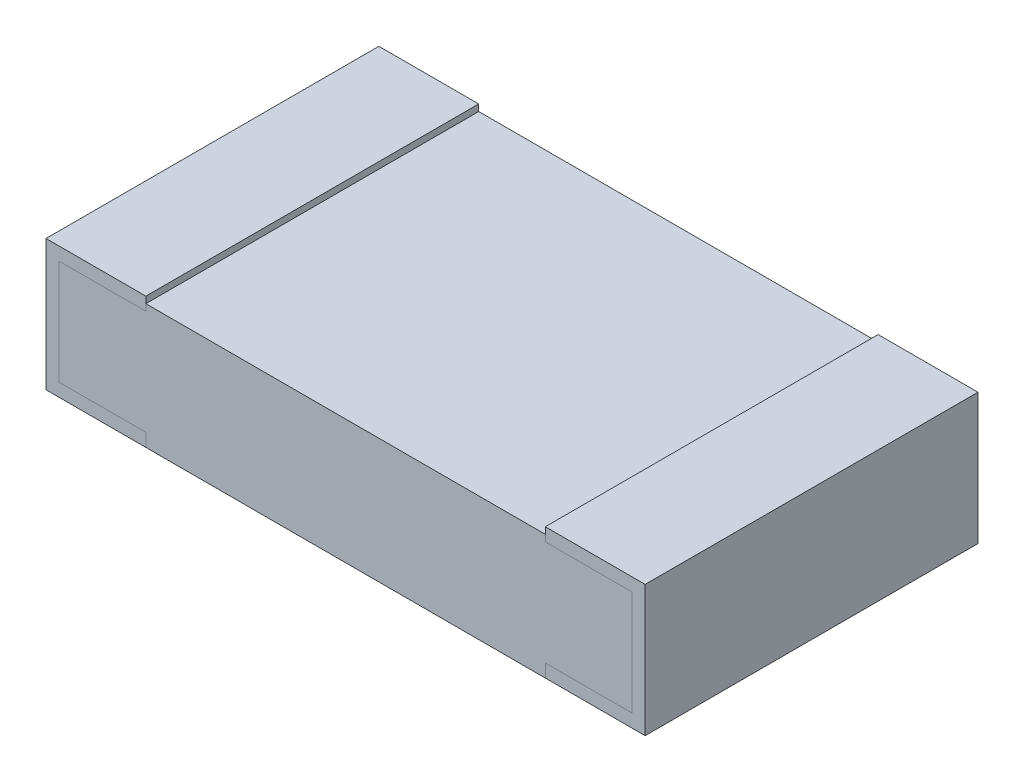
ISO-10303-21;
HEADER;
FILE_DESCRIPTION(('STEP AP214'),'2;1');
FILE_NAME('part.step','',(''),(''),'','','');
FILE_SCHEMA(('AUTOMOTIVE_DESIGN { 1 0 10303 214 1 1 1 1 }'));
ENDSEC;
DATA;
#1=APPLICATION_CONTEXT('core data for automotive mechanical design processes');
#2=APPLICATION_PROTOCOL_DEFINITION('international standard','automotive_design',2000,#1);
#3=PRODUCT_CONTEXT('',#1,'mechanical');
#4=PRODUCT('Part','Part','',(#3));
#5=PRODUCT_RELATED_PRODUCT_CATEGORY('part','',(#4));
#6=PRODUCT_DEFINITION_FORMATION('','',#4);
#7=PRODUCT_DEFINITION_CONTEXT('part definition',#1,'design');
#8=PRODUCT_DEFINITION('design','',#6,#7);
#9=PRODUCT_DEFINITION_SHAPE('','',#8);
#10=(LENGTH_UNIT() NAMED_UNIT(*) SI_UNIT(.MILLI.,.METRE.));
#11=(NAMED_UNIT(*) PLANE_ANGLE_UNIT() SI_UNIT($,.RADIAN.));
#12=(NAMED_UNIT(*) SI_UNIT($,.STERADIAN.) SOLID_ANGLE_UNIT());
#13=UNCERTAINTY_MEASURE_WITH_UNIT(LENGTH_MEASURE(1.E-05),#10,'distance_accuracy_value','');
#14=(GEOMETRIC_REPRESENTATION_CONTEXT(3) GLOBAL_UNCERTAINTY_ASSIGNED_CONTEXT((#13)) GLOBAL_UNIT_ASSIGNED_CONTEXT((#10,
#11,#12)) REPRESENTATION_CONTEXT('',''));
#15=CARTESIAN_POINT('',(0.,0.,0.));
#16=DIRECTION('',(0.,0.,1.));
#17=DIRECTION('',(1.,0.,0.));
#18=AXIS2_PLACEMENT_3D('',#15,#16,#17);
#19=CARTESIAN_POINT('',(-0.762,0.,1.27));
#20=DIRECTION('',(1.,0.,0.));
#21=DIRECTION('',(0.,1.,0.));
#22=AXIS2_PLACEMENT_3D('',#19,#20,#21);
#23=PLANE('',#22);
#24=DIRECTION('',(0.,1.,0.));
#25=VECTOR('',#24,1.);
#26=CARTESIAN_POINT('',(-0.762,0.,1.27));
#27=LINE('',#26,#25);
#28=CARTESIAN_POINT('',(-0.762,0.,1.27));
#29=VERTEX_POINT('',#28);
#30=CARTESIAN_POINT('',(-0.762,0.0499999999999999,1.27));
#31=VERTEX_POINT('',#30);
#32=EDGE_CURVE('P0_E105',#29,#31,#27,.T.);
#33=ORIENTED_EDGE('',*,*,#32,.F.);
#34=DIRECTION('',(0.,0.,1.));
#35=VECTOR('',#34,1.);
#36=CARTESIAN_POINT('',(-0.762,0.,1.27));
#37=LINE('',#36,#35);
#38=CARTESIAN_POINT('',(-0.762,0.,0.));
#39=VERTEX_POINT('',#38);
#40=EDGE_CURVE('P0_E135',#29,#39,#37,.F.);
#41=ORIENTED_EDGE('',*,*,#40,.T.);
#42=DIRECTION('',(0.,1.,0.));
#43=VECTOR('',#42,1.);
#44=CARTESIAN_POINT('',(-0.762,0.,0.));
#45=LINE('',#44,#43);
#46=CARTESIAN_POINT('',(-0.762,0.0499999999999999,0.));
#47=VERTEX_POINT('',#46);
#48=EDGE_CURVE('P0_E131',#39,#47,#45,.T.);
#49=ORIENTED_EDGE('',*,*,#48,.T.);
#50=DIRECTION('',(0.,0.,1.));
#51=VECTOR('',#50,1.);
#52=CARTESIAN_POINT('',(-0.762,0.0499999999999999,1.27));
#53=LINE('',#52,#51);
#54=EDGE_CURVE('P0_E19',#31,#47,#53,.F.);
#55=ORIENTED_EDGE('',*,*,#54,.F.);
#56=EDGE_LOOP('',(#33,#41,#49,#55));
#57=FACE_BOUND('',#56,.T.);
#58=ADVANCED_FACE('P0_F16',(#57),#23,.T.);
#59=CARTESIAN_POINT('',(0.,0.0499999999999999,1.27));
#60=DIRECTION('',(0.,1.,0.));
#61=DIRECTION('',(0.,0.,1.));
#62=AXIS2_PLACEMENT_3D('',#59,#60,#61);
#63=PLANE('',#62);
#64=DIRECTION('',(1.,0.,0.));
#65=VECTOR('',#64,1.);
#66=CARTESIAN_POINT('',(0.,0.0499999999999999,1.27));
#67=LINE('',#66,#65);
#68=CARTESIAN_POINT('',(-1.093,0.0499999999999999,1.27));
#69=VERTEX_POINT('',#68);
#70=EDGE_CURVE('P0_E107',#31,#69,#67,.F.);
#71=ORIENTED_EDGE('',*,*,#70,.F.);
#72=ORIENTED_EDGE('',*,*,#54,.T.);
#73=DIRECTION('',(1.,0.,0.));
#74=VECTOR('',#73,1.);
#75=CARTESIAN_POINT('',(0.,0.0499999999999999,0.));
#76=LINE('',#75,#74);
#77=CARTESIAN_POINT('',(-1.093,0.0499999999999999,0.));
#78=VERTEX_POINT('',#77);
#79=EDGE_CURVE('P0_E126',#47,#78,#76,.F.);
#80=ORIENTED_EDGE('',*,*,#79,.T.);
#81=DIRECTION('',(0.,0.,-1.));
#82=VECTOR('',#81,1.);
#83=CARTESIAN_POINT('',(-1.093,0.0499999999999999,1.27));
#84=LINE('',#83,#82);
#85=EDGE_CURVE('P0_E114',#69,#78,#84,.T.);
#86=ORIENTED_EDGE('',*,*,#85,.F.);
#87=EDGE_LOOP('',(#71,#72,#80,#86));
#88=FACE_BOUND('',#87,.T.);
#89=ADVANCED_FACE('P0_F125',(#88),#63,.T.);
#90=CARTESIAN_POINT('',(-1.093,0.,1.27));
#91=DIRECTION('',(1.,0.,0.));
#92=DIRECTION('',(0.,0.,-1.));
#93=AXIS2_PLACEMENT_3D('',#90,#91,#92);
#94=PLANE('',#93);
#95=DIRECTION('',(0.,1.,0.));
#96=VECTOR('',#95,1.);
#97=CARTESIAN_POINT('',(-1.093,0.,1.27));
#98=LINE('',#97,#96);
#99=CARTESIAN_POINT('',(-1.093,0.45,1.27));
#100=VERTEX_POINT('',#99);
#101=EDGE_CURVE('P0_E147',#69,#100,#98,.T.);
#102=ORIENTED_EDGE('',*,*,#101,.F.);
#103=ORIENTED_EDGE('',*,*,#85,.T.);
#104=DIRECTION('',(0.,1.,0.));
#105=VECTOR('',#104,1.);
#106=CARTESIAN_POINT('',(-1.093,0.,0.));
#107=LINE('',#106,#105);
#108=CARTESIAN_POINT('',(-1.093,0.45,0.));
#109=VERTEX_POINT('',#108);
#110=EDGE_CURVE('P0_E132',#78,#109,#107,.T.);
#111=ORIENTED_EDGE('',*,*,#110,.T.);
#112=DIRECTION('',(0.,0.,1.));
#113=VECTOR('',#112,1.);
#114=CARTESIAN_POINT('',(-1.093,0.45,1.27));
#115=LINE('',#114,#113);
#116=EDGE_CURVE('P0_E112',#109,#100,#115,.T.);
#117=ORIENTED_EDGE('',*,*,#116,.T.);
#118=EDGE_LOOP('',(#102,#103,#111,#117));
#119=FACE_BOUND('',#118,.T.);
#120=ADVANCED_FACE('P0_F148',(#119),#94,.T.);
#121=CARTESIAN_POINT('',(0.,0.45,1.27));
#122=DIRECTION('',(0.,1.,0.));
#123=DIRECTION('',(0.,0.,1.));
#124=AXIS2_PLACEMENT_3D('',#121,#122,#123);
#125=PLANE('',#124);
#126=DIRECTION('',(0.,0.,1.));
#127=VECTOR('',#126,1.);
#128=CARTESIAN_POINT('',(-0.762,0.45,1.27));
#129=LINE('',#128,#127);
#130=CARTESIAN_POINT('',(-0.762,0.45,1.27));
#131=VERTEX_POINT('',#130);
#132=CARTESIAN_POINT('',(-0.762,0.45,0.));
#133=VERTEX_POINT('',#132);
#134=EDGE_CURVE('P0_E78',#131,#133,#129,.F.);
#135=ORIENTED_EDGE('',*,*,#134,.F.);
#136=DIRECTION('',(1.,0.,0.));
#137=VECTOR('',#136,1.);
#138=CARTESIAN_POINT('',(0.,0.45,1.27));
#139=LINE('',#138,#137);
#140=EDGE_CURVE('P0_E90',#100,#131,#139,.T.);
#141=ORIENTED_EDGE('',*,*,#140,.F.);
#142=ORIENTED_EDGE('',*,*,#116,.F.);
#143=DIRECTION('',(1.,0.,0.));
#144=VECTOR('',#143,1.);
#145=CARTESIAN_POINT('',(0.,0.45,0.));
#146=LINE('',#145,#144);
#147=EDGE_CURVE('P0_E248',#109,#133,#146,.T.);
#148=ORIENTED_EDGE('',*,*,#147,.T.);
#149=EDGE_LOOP('',(#135,#141,#142,#148));
#150=FACE_BOUND('',#149,.T.);
#151=ADVANCED_FACE('P0_F149',(#150),#125,.F.);
#152=CARTESIAN_POINT('',(-0.762,0.,1.27));
#153=DIRECTION('',(1.,0.,0.));
#154=DIRECTION('',(0.,1.,0.));
#155=AXIS2_PLACEMENT_3D('',#152,#153,#154);
#156=PLANE('',#155);
#157=DIRECTION('',(0.,1.,0.));
#158=VECTOR('',#157,1.);
#159=CARTESIAN_POINT('',(-0.762,0.,1.27));
#160=LINE('',#159,#158);
#161=CARTESIAN_POINT('',(-0.762,0.5,1.27));
#162=VERTEX_POINT('',#161);
#163=EDGE_CURVE('P0_E83',#131,#162,#160,.T.);
#164=ORIENTED_EDGE('',*,*,#163,.F.);
#165=ORIENTED_EDGE('',*,*,#134,.T.);
#166=DIRECTION('',(0.,1.,0.));
#167=VECTOR('',#166,1.);
#168=CARTESIAN_POINT('',(-0.762,0.,0.));
#169=LINE('',#168,#167);
#170=CARTESIAN_POINT('',(-0.762,0.5,0.));
#171=VERTEX_POINT('',#170);
#172=EDGE_CURVE('P0_E97',#133,#171,#169,.T.);
#173=ORIENTED_EDGE('',*,*,#172,.T.);
#174=DIRECTION('',(0.,0.,1.));
#175=VECTOR('',#174,1.);
#176=CARTESIAN_POINT('',(-0.762,0.5,1.27));
#177=LINE('',#176,#175);
#178=EDGE_CURVE('P0_E92',#162,#171,#177,.F.);
#179=ORIENTED_EDGE('',*,*,#178,.F.);
#180=EDGE_LOOP('',(#164,#165,#173,#179));
#181=FACE_BOUND('',#180,.T.);
#182=ADVANCED_FACE('P0_F95',(#181),#156,.T.);
#183=CARTESIAN_POINT('',(0.,0.5,1.27));
#184=DIRECTION('',(0.,1.,0.));
#185=DIRECTION('',(0.,0.,1.));
#186=AXIS2_PLACEMENT_3D('',#183,#184,#185);
#187=PLANE('',#186);
#188=DIRECTION('',(1.,0.,0.));
#189=VECTOR('',#188,1.);
#190=CARTESIAN_POINT('',(0.,0.5,1.27));
#191=LINE('',#190,#189);
#192=CARTESIAN_POINT('',(-1.143,0.5,1.27));
#193=VERTEX_POINT('',#192);
#194=EDGE_CURVE('P0_E88',#162,#193,#191,.F.);
#195=ORIENTED_EDGE('',*,*,#194,.F.);
#196=ORIENTED_EDGE('',*,*,#178,.T.);
#197=DIRECTION('',(1.,0.,0.));
#198=VECTOR('',#197,1.);
#199=CARTESIAN_POINT('',(0.,0.5,0.));
#200=LINE('',#199,#198);
#201=CARTESIAN_POINT('',(-1.143,0.5,0.));
#202=VERTEX_POINT('',#201);
#203=EDGE_CURVE('P0_E137',#171,#202,#200,.F.);
#204=ORIENTED_EDGE('',*,*,#203,.T.);
#205=DIRECTION('',(0.,0.,-1.));
#206=VECTOR('',#205,1.);
#207=CARTESIAN_POINT('',(-1.143,0.5,1.27));
#208=LINE('',#207,#206);
#209=EDGE_CURVE('P0_E104',#202,#193,#208,.F.);
#210=ORIENTED_EDGE('',*,*,#209,.T.);
#211=EDGE_LOOP('',(#195,#196,#204,#210));
#212=FACE_BOUND('',#211,.T.);
#213=ADVANCED_FACE('P0_F103',(#212),#187,.T.);
#214=CARTESIAN_POINT('',(0.,0.,1.27));
#215=DIRECTION('',(0.,0.,1.));
#216=DIRECTION('',(1.,0.,0.));
#217=AXIS2_PLACEMENT_3D('',#214,#215,#216);
#218=PLANE('',#217);
#219=ORIENTED_EDGE('',*,*,#101,.T.);
#220=ORIENTED_EDGE('',*,*,#140,.T.);
#221=ORIENTED_EDGE('',*,*,#163,.T.);
#222=ORIENTED_EDGE('',*,*,#194,.T.);
#223=DIRECTION('',(0.,1.,0.));
#224=VECTOR('',#223,1.);
#225=CARTESIAN_POINT('',(-1.143,0.,1.27));
#226=LINE('',#225,#224);
#227=CARTESIAN_POINT('',(-1.143,0.,1.27));
#228=VERTEX_POINT('',#227);
#229=EDGE_CURVE('P0_E242',#193,#228,#226,.F.);
#230=ORIENTED_EDGE('',*,*,#229,.T.);
#231=DIRECTION('',(1.,0.,0.));
#232=VECTOR('',#231,1.);
#233=CARTESIAN_POINT('',(0.,0.,1.27));
#234=LINE('',#233,#232);
#235=EDGE_CURVE('P0_E143',#228,#29,#234,.T.);
#236=ORIENTED_EDGE('',*,*,#235,.T.);
#237=ORIENTED_EDGE('',*,*,#32,.T.);
#238=ORIENTED_EDGE('',*,*,#70,.T.);
#239=EDGE_LOOP('',(#219,#220,#221,#222,#230,#236,#237,#238));
#240=FACE_BOUND('',#239,.T.);
#241=ADVANCED_FACE('P0_F85',(#240),#218,.T.);
#242=CARTESIAN_POINT('',(0.,0.,1.27));
#243=DIRECTION('',(0.,1.,0.));
#244=DIRECTION('',(0.,0.,1.));
#245=AXIS2_PLACEMENT_3D('',#242,#243,#244);
#246=PLANE('',#245);
#247=ORIENTED_EDGE('',*,*,#40,.F.);
#248=ORIENTED_EDGE('',*,*,#235,.F.);
#249=DIRECTION('',(0.,0.,-1.));
#250=VECTOR('',#249,1.);
#251=CARTESIAN_POINT('',(-1.143,0.,1.27));
#252=LINE('',#251,#250);
#253=CARTESIAN_POINT('',(-1.143,0.,0.));
#254=VERTEX_POINT('',#253);
#255=EDGE_CURVE('P0_E25',#228,#254,#252,.T.);
#256=ORIENTED_EDGE('',*,*,#255,.T.);
#257=DIRECTION('',(1.,0.,0.));
#258=VECTOR('',#257,1.);
#259=CARTESIAN_POINT('',(0.,0.,0.));
#260=LINE('',#259,#258);
#261=EDGE_CURVE('P0_E33',#254,#39,#260,.T.);
#262=ORIENTED_EDGE('',*,*,#261,.T.);
#263=EDGE_LOOP('',(#247,#248,#256,#262));
#264=FACE_BOUND('',#263,.T.);
#265=ADVANCED_FACE('P0_F166',(#264),#246,.F.);
#266=CARTESIAN_POINT('',(0.,0.,0.));
#267=DIRECTION('',(0.,0.,1.));
#268=DIRECTION('',(1.,0.,0.));
#269=AXIS2_PLACEMENT_3D('',#266,#267,#268);
#270=PLANE('',#269);
#271=ORIENTED_EDGE('',*,*,#147,.F.);
#272=ORIENTED_EDGE('',*,*,#110,.F.);
#273=ORIENTED_EDGE('',*,*,#79,.F.);
#274=ORIENTED_EDGE('',*,*,#48,.F.);
#275=ORIENTED_EDGE('',*,*,#261,.F.);
#276=DIRECTION('',(0.,1.,0.));
#277=VECTOR('',#276,1.);
#278=CARTESIAN_POINT('',(-1.143,0.,0.));
#279=LINE('',#278,#277);
#280=EDGE_CURVE('P0_E11',#254,#202,#279,.T.);
#281=ORIENTED_EDGE('',*,*,#280,.T.);
#282=ORIENTED_EDGE('',*,*,#203,.F.);
#283=ORIENTED_EDGE('',*,*,#172,.F.);
#284=EDGE_LOOP('',(#271,#272,#273,#274,#275,#281,#282,#283));
#285=FACE_BOUND('',#284,.T.);
#286=ADVANCED_FACE('P0_F130',(#285),#270,.F.);
#287=CARTESIAN_POINT('',(-1.143,0.,1.27));
#288=DIRECTION('',(1.,0.,0.));
#289=DIRECTION('',(0.,0.,-1.));
#290=AXIS2_PLACEMENT_3D('',#287,#288,#289);
#291=PLANE('',#290);
#292=ORIENTED_EDGE('',*,*,#255,.F.);
#293=ORIENTED_EDGE('',*,*,#229,.F.);
#294=ORIENTED_EDGE('',*,*,#209,.F.);
#295=ORIENTED_EDGE('',*,*,#280,.F.);
#296=EDGE_LOOP('',(#292,#293,#294,#295));
#297=FACE_BOUND('',#296,.T.);
#298=ADVANCED_FACE('P0_F159',(#297),#291,.F.);
#299=CLOSED_SHELL('',(#58,#89,#120,#151,#182,#213,#241,#265,#286,#298));
#300=MANIFOLD_SOLID_BREP('P0_B1',#299);
#301=CARTESIAN_POINT('',(0.762,0.,1.27));
#302=DIRECTION('',(1.,0.,0.));
#303=DIRECTION('',(0.,1.,0.));
#304=AXIS2_PLACEMENT_3D('',#301,#302,#303);
#305=PLANE('',#304);
#306=DIRECTION('',(0.,1.,0.));
#307=VECTOR('',#306,1.);
#308=CARTESIAN_POINT('',(0.762,0.,1.27));
#309=LINE('',#308,#307);
#310=CARTESIAN_POINT('',(0.762,0.,1.27));
#311=VERTEX_POINT('',#310);
#312=CARTESIAN_POINT('',(0.762,0.0499999999999999,1.27));
#313=VERTEX_POINT('',#312);
#314=EDGE_CURVE('P1_E172',#311,#313,#309,.T.);
#315=ORIENTED_EDGE('',*,*,#314,.F.);
#316=DIRECTION('',(0.,0.,1.));
#317=VECTOR('',#316,1.);
#318=CARTESIAN_POINT('',(0.762,0.,1.27));
#319=LINE('',#318,#317);
#320=CARTESIAN_POINT('',(0.762,0.,0.));
#321=VERTEX_POINT('',#320);
#322=EDGE_CURVE('P1_E133',#311,#321,#319,.F.);
#323=ORIENTED_EDGE('',*,*,#322,.T.);
#324=DIRECTION('',(0.,1.,0.));
#325=VECTOR('',#324,1.);
#326=CARTESIAN_POINT('',(0.762,0.,0.));
#327=LINE('',#326,#325);
#328=CARTESIAN_POINT('',(0.762,0.0499999999999999,0.));
#329=VERTEX_POINT('',#328);
#330=EDGE_CURVE('P1_E179',#321,#329,#327,.T.);
#331=ORIENTED_EDGE('',*,*,#330,.T.);
#332=DIRECTION('',(0.,0.,1.));
#333=VECTOR('',#332,1.);
#334=CARTESIAN_POINT('',(0.762,0.0499999999999999,1.27));
#335=LINE('',#334,#333);
#336=EDGE_CURVE('P1_E19',#329,#313,#335,.T.);
#337=ORIENTED_EDGE('',*,*,#336,.T.);
#338=EDGE_LOOP('',(#315,#323,#331,#337));
#339=FACE_BOUND('',#338,.T.);
#340=ADVANCED_FACE('P1_F16',(#339),#305,.T.);
#341=CARTESIAN_POINT('',(-1.093,0.0499999999999999,1.27));
#342=DIRECTION('',(0.,1.,0.));
#343=DIRECTION('',(0.,0.,1.));
#344=AXIS2_PLACEMENT_3D('',#341,#342,#343);
#345=PLANE('',#344);
#346=ORIENTED_EDGE('',*,*,#336,.F.);
#347=DIRECTION('',(1.,0.,0.));
#348=VECTOR('',#347,1.);
#349=CARTESIAN_POINT('',(0.,0.0499999999999999,0.));
#350=LINE('',#349,#348);
#351=CARTESIAN_POINT('',(1.093,0.0499999999999999,0.));
#352=VERTEX_POINT('',#351);
#353=EDGE_CURVE('P1_E104',#329,#352,#350,.T.);
#354=ORIENTED_EDGE('',*,*,#353,.T.);
#355=DIRECTION('',(0.,0.,1.));
#356=VECTOR('',#355,1.);
#357=CARTESIAN_POINT('',(1.093,0.0499999999999999,1.27));
#358=LINE('',#357,#356);
#359=CARTESIAN_POINT('',(1.093,0.0499999999999999,1.27));
#360=VERTEX_POINT('',#359);
#361=EDGE_CURVE('P1_E107',#360,#352,#358,.F.);
#362=ORIENTED_EDGE('',*,*,#361,.F.);
#363=DIRECTION('',(1.,0.,0.));
#364=VECTOR('',#363,1.);
#365=CARTESIAN_POINT('',(0.,0.0499999999999999,1.27));
#366=LINE('',#365,#364);
#367=EDGE_CURVE('P1_E170',#313,#360,#366,.T.);
#368=ORIENTED_EDGE('',*,*,#367,.F.);
#369=EDGE_LOOP('',(#346,#354,#362,#368));
#370=FACE_BOUND('',#369,.T.);
#371=ADVANCED_FACE('P1_F106',(#370),#345,.F.);
#372=CARTESIAN_POINT('',(1.093,0.45,1.27));
#373=DIRECTION('',(1.,0.,0.));
#374=DIRECTION('',(0.,1.,0.));
#375=AXIS2_PLACEMENT_3D('',#372,#373,#374);
#376=PLANE('',#375);
#377=DIRECTION('',(0.,1.,0.));
#378=VECTOR('',#377,1.);
#379=CARTESIAN_POINT('',(1.093,0.,1.27));
#380=LINE('',#379,#378);
#381=CARTESIAN_POINT('',(1.093,0.45,1.27));
#382=VERTEX_POINT('',#381);
#383=EDGE_CURVE('P1_E119',#360,#382,#380,.T.);
#384=ORIENTED_EDGE('',*,*,#383,.F.);
#385=ORIENTED_EDGE('',*,*,#361,.T.);
#386=DIRECTION('',(0.,1.,0.));
#387=VECTOR('',#386,1.);
#388=CARTESIAN_POINT('',(1.093,0.,0.));
#389=LINE('',#388,#387);
#390=CARTESIAN_POINT('',(1.093,0.45,0.));
#391=VERTEX_POINT('',#390);
#392=EDGE_CURVE('P1_E112',#352,#391,#389,.T.);
#393=ORIENTED_EDGE('',*,*,#392,.T.);
#394=DIRECTION('',(0.,0.,1.));
#395=VECTOR('',#394,1.);
#396=CARTESIAN_POINT('',(1.093,0.45,1.27));
#397=LINE('',#396,#395);
#398=EDGE_CURVE('P1_E113',#382,#391,#397,.F.);
#399=ORIENTED_EDGE('',*,*,#398,.F.);
#400=EDGE_LOOP('',(#384,#385,#393,#399));
#401=FACE_BOUND('',#400,.T.);
#402=ADVANCED_FACE('P1_F116',(#401),#376,.T.);
#403=CARTESIAN_POINT('',(-1.093,0.45,1.27));
#404=DIRECTION('',(0.,1.,0.));
#405=DIRECTION('',(0.,0.,1.));
#406=AXIS2_PLACEMENT_3D('',#403,#404,#405);
#407=PLANE('',#406);
#408=DIRECTION('',(1.,0.,0.));
#409=VECTOR('',#408,1.);
#410=CARTESIAN_POINT('',(0.,0.45,0.));
#411=LINE('',#410,#409);
#412=CARTESIAN_POINT('',(-0.762,0.45,0.));
#413=VERTEX_POINT('',#412);
#414=CARTESIAN_POINT('',(-1.093,0.45,0.));
#415=VERTEX_POINT('',#414);
#416=EDGE_CURVE('P1_E128',#413,#415,#411,.F.);
#417=ORIENTED_EDGE('',*,*,#416,.T.);
#418=DIRECTION('',(0.,0.,-1.));
#419=VECTOR('',#418,1.);
#420=CARTESIAN_POINT('',(-1.093,0.45,1.27));
#421=LINE('',#420,#419);
#422=CARTESIAN_POINT('',(-1.093,0.45,1.27));
#423=VERTEX_POINT('',#422);
#424=EDGE_CURVE('P1_E121',#415,#423,#421,.F.);
#425=ORIENTED_EDGE('',*,*,#424,.T.);
#426=DIRECTION('',(1.,0.,0.));
#427=VECTOR('',#426,1.);
#428=CARTESIAN_POINT('',(0.,0.45,1.27));
#429=LINE('',#428,#427);
#430=CARTESIAN_POINT('',(-0.762,0.45,1.27));
#431=VERTEX_POINT('',#430);
#432=EDGE_CURVE('P1_E147',#431,#423,#429,.F.);
#433=ORIENTED_EDGE('',*,*,#432,.F.);
#434=DIRECTION('',(0.,0.,1.));
#435=VECTOR('',#434,1.);
#436=CARTESIAN_POINT('',(-0.762,0.45,1.27));
#437=LINE('',#436,#435);
#438=EDGE_CURVE('P1_E177',#431,#413,#437,.F.);
#439=ORIENTED_EDGE('',*,*,#438,.T.);
#440=EDGE_LOOP('',(#417,#425,#433,#439));
#441=FACE_BOUND('',#440,.T.);
#442=ADVANCED_FACE('P1_F145',(#441),#407,.T.);
#443=CARTESIAN_POINT('',(-1.093,0.45,1.27));
#444=DIRECTION('',(1.,0.,0.));
#445=DIRECTION('',(0.,0.,-1.));
#446=AXIS2_PLACEMENT_3D('',#443,#444,#445);
#447=PLANE('',#446);
#448=DIRECTION('',(0.,0.,1.));
#449=VECTOR('',#448,1.);
#450=CARTESIAN_POINT('',(-1.093,0.0499999999999999,1.27));
#451=LINE('',#450,#449);
#452=CARTESIAN_POINT('',(-1.093,0.0499999999999999,0.));
#453=VERTEX_POINT('',#452);
#454=CARTESIAN_POINT('',(-1.093,0.0499999999999999,1.27));
#455=VERTEX_POINT('',#454);
#456=EDGE_CURVE('P1_E139',#453,#455,#451,.T.);
#457=ORIENTED_EDGE('',*,*,#456,.T.);
#458=DIRECTION('',(0.,1.,0.));
#459=VECTOR('',#458,1.);
#460=CARTESIAN_POINT('',(-1.093,0.,1.27));
#461=LINE('',#460,#459);
#462=EDGE_CURVE('P1_E153',#423,#455,#461,.F.);
#463=ORIENTED_EDGE('',*,*,#462,.F.);
#464=ORIENTED_EDGE('',*,*,#424,.F.);
#465=DIRECTION('',(0.,1.,0.));
#466=VECTOR('',#465,1.);
#467=CARTESIAN_POINT('',(-1.093,0.,0.));
#468=LINE('',#467,#466);
#469=EDGE_CURVE('P1_E188',#415,#453,#468,.F.);
#470=ORIENTED_EDGE('',*,*,#469,.T.);
#471=EDGE_LOOP('',(#457,#463,#464,#470));
#472=FACE_BOUND('',#471,.T.);
#473=ADVANCED_FACE('P1_F154',(#472),#447,.F.);
#474=CARTESIAN_POINT('',(-1.093,0.0499999999999999,1.27));
#475=DIRECTION('',(0.,1.,0.));
#476=DIRECTION('',(0.,0.,1.));
#477=AXIS2_PLACEMENT_3D('',#474,#475,#476);
#478=PLANE('',#477);
#479=DIRECTION('',(1.,0.,0.));
#480=VECTOR('',#479,1.);
#481=CARTESIAN_POINT('',(0.,0.0499999999999999,1.27));
#482=LINE('',#481,#480);
#483=CARTESIAN_POINT('',(-0.762,0.0499999999999999,1.27));
#484=VERTEX_POINT('',#483);
#485=EDGE_CURVE('P1_E158',#455,#484,#482,.T.);
#486=ORIENTED_EDGE('',*,*,#485,.F.);
#487=ORIENTED_EDGE('',*,*,#456,.F.);
#488=DIRECTION('',(1.,0.,0.));
#489=VECTOR('',#488,1.);
#490=CARTESIAN_POINT('',(0.,0.0499999999999999,0.));
#491=LINE('',#490,#489);
#492=CARTESIAN_POINT('',(-0.762,0.0499999999999999,0.));
#493=VERTEX_POINT('',#492);
#494=EDGE_CURVE('P1_E186',#453,#493,#491,.T.);
#495=ORIENTED_EDGE('',*,*,#494,.T.);
#496=DIRECTION('',(0.,0.,1.));
#497=VECTOR('',#496,1.);
#498=CARTESIAN_POINT('',(-0.762,0.0499999999999999,1.27));
#499=LINE('',#498,#497);
#500=EDGE_CURVE('P1_E137',#493,#484,#499,.T.);
#501=ORIENTED_EDGE('',*,*,#500,.T.);
#502=EDGE_LOOP('',(#486,#487,#495,#501));
#503=FACE_BOUND('',#502,.T.);
#504=ADVANCED_FACE('P1_F191',(#503),#478,.F.);
#505=CARTESIAN_POINT('',(-0.762,0.,1.27));
#506=DIRECTION('',(1.,0.,0.));
#507=DIRECTION('',(0.,1.,0.));
#508=AXIS2_PLACEMENT_3D('',#505,#506,#507);
#509=PLANE('',#508);
#510=DIRECTION('',(0.,0.,1.));
#511=VECTOR('',#510,1.);
#512=CARTESIAN_POINT('',(-0.762,0.,1.27));
#513=LINE('',#512,#511);
#514=CARTESIAN_POINT('',(-0.762,0.,0.));
#515=VERTEX_POINT('',#514);
#516=CARTESIAN_POINT('',(-0.762,0.,1.27));
#517=VERTEX_POINT('',#516);
#518=EDGE_CURVE('P1_E135',#515,#517,#513,.T.);
#519=ORIENTED_EDGE('',*,*,#518,.T.);
#520=DIRECTION('',(0.,1.,0.));
#521=VECTOR('',#520,1.);
#522=CARTESIAN_POINT('',(-0.762,0.,1.27));
#523=LINE('',#522,#521);
#524=EDGE_CURVE('P1_E205',#484,#517,#523,.F.);
#525=ORIENTED_EDGE('',*,*,#524,.F.);
#526=ORIENTED_EDGE('',*,*,#500,.F.);
#527=DIRECTION('',(0.,1.,0.));
#528=VECTOR('',#527,1.);
#529=CARTESIAN_POINT('',(-0.762,0.,0.));
#530=LINE('',#529,#528);
#531=EDGE_CURVE('P1_E184',#493,#515,#530,.F.);
#532=ORIENTED_EDGE('',*,*,#531,.T.);
#533=EDGE_LOOP('',(#519,#525,#526,#532));
#534=FACE_BOUND('',#533,.T.);
#535=ADVANCED_FACE('P1_F196',(#534),#509,.F.);
#536=CARTESIAN_POINT('',(0.,0.,1.27));
#537=DIRECTION('',(0.,1.,0.));
#538=DIRECTION('',(0.,0.,1.));
#539=AXIS2_PLACEMENT_3D('',#536,#537,#538);
#540=PLANE('',#539);
#541=ORIENTED_EDGE('',*,*,#322,.F.);
#542=DIRECTION('',(1.,0.,0.));
#543=VECTOR('',#542,1.);
#544=CARTESIAN_POINT('',(0.,0.,1.27));
#545=LINE('',#544,#543);
#546=EDGE_CURVE('P1_E203',#517,#311,#545,.T.);
#547=ORIENTED_EDGE('',*,*,#546,.F.);
#548=ORIENTED_EDGE('',*,*,#518,.F.);
#549=DIRECTION('',(1.,0.,0.));
#550=VECTOR('',#549,1.);
#551=CARTESIAN_POINT('',(0.,0.,0.));
#552=LINE('',#551,#550);
#553=EDGE_CURVE('P1_E181',#515,#321,#552,.T.);
#554=ORIENTED_EDGE('',*,*,#553,.T.);
#555=EDGE_LOOP('',(#541,#547,#548,#554));
#556=FACE_BOUND('',#555,.T.);
#557=ADVANCED_FACE('P1_F201',(#556),#540,.F.);
#558=CARTESIAN_POINT('',(-1.093,0.45,1.27));
#559=DIRECTION('',(0.,1.,0.));
#560=DIRECTION('',(0.,0.,1.));
#561=AXIS2_PLACEMENT_3D('',#558,#559,#560);
#562=PLANE('',#561);
#563=ORIENTED_EDGE('',*,*,#398,.T.);
#564=DIRECTION('',(1.,0.,0.));
#565=VECTOR('',#564,1.);
#566=CARTESIAN_POINT('',(0.,0.45,0.));
#567=LINE('',#566,#565);
#568=CARTESIAN_POINT('',(0.762,0.45,0.));
#569=VERTEX_POINT('',#568);
#570=EDGE_CURVE('P1_E126',#391,#569,#567,.F.);
#571=ORIENTED_EDGE('',*,*,#570,.T.);
#572=DIRECTION('',(0.,0.,1.));
#573=VECTOR('',#572,1.);
#574=CARTESIAN_POINT('',(0.762,0.45,1.27));
#575=LINE('',#574,#573);
#576=CARTESIAN_POINT('',(0.762,0.45,1.27));
#577=VERTEX_POINT('',#576);
#578=EDGE_CURVE('P1_E212',#577,#569,#575,.F.);
#579=ORIENTED_EDGE('',*,*,#578,.F.);
#580=DIRECTION('',(1.,0.,0.));
#581=VECTOR('',#580,1.);
#582=CARTESIAN_POINT('',(0.,0.45,1.27));
#583=LINE('',#582,#581);
#584=EDGE_CURVE('P1_E164',#382,#577,#583,.F.);
#585=ORIENTED_EDGE('',*,*,#584,.F.);
#586=EDGE_LOOP('',(#563,#571,#579,#585));
#587=FACE_BOUND('',#586,.T.);
#588=ADVANCED_FACE('P1_F233',(#587),#562,.T.);
#589=CARTESIAN_POINT('',(0.,0.,0.));
#590=DIRECTION('',(0.,0.,1.));
#591=DIRECTION('',(1.,0.,0.));
#592=AXIS2_PLACEMENT_3D('',#589,#590,#591);
#593=PLANE('',#592);
#594=ORIENTED_EDGE('',*,*,#553,.F.);
#595=ORIENTED_EDGE('',*,*,#531,.F.);
#596=ORIENTED_EDGE('',*,*,#494,.F.);
#597=ORIENTED_EDGE('',*,*,#469,.F.);
#598=ORIENTED_EDGE('',*,*,#416,.F.);
#599=DIRECTION('',(0.,1.,0.));
#600=VECTOR('',#599,1.);
#601=CARTESIAN_POINT('',(-0.762,0.,0.));
#602=LINE('',#601,#600);
#603=CARTESIAN_POINT('',(-0.762,0.475,0.));
#604=VERTEX_POINT('',#603);
#605=EDGE_CURVE('P1_E175',#413,#604,#602,.T.);
#606=ORIENTED_EDGE('',*,*,#605,.T.);
#607=DIRECTION('',(1.,0.,0.));
#608=VECTOR('',#607,1.);
#609=CARTESIAN_POINT('',(0.,0.475,0.));
#610=LINE('',#609,#608);
#611=CARTESIAN_POINT('',(0.762,0.475,0.));
#612=VERTEX_POINT('',#611);
#613=EDGE_CURVE('P1_E215',#612,#604,#610,.F.);
#614=ORIENTED_EDGE('',*,*,#613,.F.);
#615=DIRECTION('',(0.,1.,0.));
#616=VECTOR('',#615,1.);
#617=CARTESIAN_POINT('',(0.762,0.,0.));
#618=LINE('',#617,#616);
#619=EDGE_CURVE('P1_E204',#569,#612,#618,.T.);
#620=ORIENTED_EDGE('',*,*,#619,.F.);
#621=ORIENTED_EDGE('',*,*,#570,.F.);
#622=ORIENTED_EDGE('',*,*,#392,.F.);
#623=ORIENTED_EDGE('',*,*,#353,.F.);
#624=ORIENTED_EDGE('',*,*,#330,.F.);
#625=EDGE_LOOP('',(#594,#595,#596,#597,#598,#606,#614,#620,#621,#622,#623,#624));
#626=FACE_BOUND('',#625,.T.);
#627=ADVANCED_FACE('P1_F124',(#626),#593,.F.);
#628=CARTESIAN_POINT('',(-0.762,0.,1.27));
#629=DIRECTION('',(1.,0.,0.));
#630=DIRECTION('',(0.,1.,0.));
#631=AXIS2_PLACEMENT_3D('',#628,#629,#630);
#632=PLANE('',#631);
#633=ORIENTED_EDGE('',*,*,#438,.F.);
#634=DIRECTION('',(0.,1.,0.));
#635=VECTOR('',#634,1.);
#636=CARTESIAN_POINT('',(-0.762,0.,1.27));
#637=LINE('',#636,#635);
#638=CARTESIAN_POINT('',(-0.762,0.475,1.27));
#639=VERTEX_POINT('',#638);
#640=EDGE_CURVE('P1_E162',#639,#431,#637,.F.);
#641=ORIENTED_EDGE('',*,*,#640,.F.);
#642=DIRECTION('',(0.,0.,1.));
#643=VECTOR('',#642,1.);
#644=CARTESIAN_POINT('',(-0.762,0.475,1.27));
#645=LINE('',#644,#643);
#646=EDGE_CURVE('P1_E218',#604,#639,#645,.T.);
#647=ORIENTED_EDGE('',*,*,#646,.F.);
#648=ORIENTED_EDGE('',*,*,#605,.F.);
#649=EDGE_LOOP('',(#633,#641,#647,#648));
#650=FACE_BOUND('',#649,.T.);
#651=ADVANCED_FACE('P1_F227',(#650),#632,.F.);
#652=CARTESIAN_POINT('',(0.,0.,1.27));
#653=DIRECTION('',(0.,0.,1.));
#654=DIRECTION('',(1.,0.,0.));
#655=AXIS2_PLACEMENT_3D('',#652,#653,#654);
#656=PLANE('',#655);
#657=ORIENTED_EDGE('',*,*,#524,.T.);
#658=ORIENTED_EDGE('',*,*,#546,.T.);
#659=ORIENTED_EDGE('',*,*,#314,.T.);
#660=ORIENTED_EDGE('',*,*,#367,.T.);
#661=ORIENTED_EDGE('',*,*,#383,.T.);
#662=ORIENTED_EDGE('',*,*,#584,.T.);
#663=DIRECTION('',(0.,1.,0.));
#664=VECTOR('',#663,1.);
#665=CARTESIAN_POINT('',(0.762,0.,1.27));
#666=LINE('',#665,#664);
#667=CARTESIAN_POINT('',(0.762,0.475,1.27));
#668=VERTEX_POINT('',#667);
#669=EDGE_CURVE('P1_E34',#668,#577,#666,.F.);
#670=ORIENTED_EDGE('',*,*,#669,.F.);
#671=DIRECTION('',(1.,0.,0.));
#672=VECTOR('',#671,1.);
#673=CARTESIAN_POINT('',(0.,0.475,1.27));
#674=LINE('',#673,#672);
#675=EDGE_CURVE('P1_E25',#639,#668,#674,.T.);
#676=ORIENTED_EDGE('',*,*,#675,.F.);
#677=ORIENTED_EDGE('',*,*,#640,.T.);
#678=ORIENTED_EDGE('',*,*,#432,.T.);
#679=ORIENTED_EDGE('',*,*,#462,.T.);
#680=ORIENTED_EDGE('',*,*,#485,.T.);
#681=EDGE_LOOP('',(#657,#658,#659,#660,#661,#662,#670,#676,#677,#678,#679,#680));
#682=FACE_BOUND('',#681,.T.);
#683=ADVANCED_FACE('P1_F161',(#682),#656,.T.);
#684=CARTESIAN_POINT('',(0.762,0.,1.27));
#685=DIRECTION('',(1.,0.,0.));
#686=DIRECTION('',(0.,1.,0.));
#687=AXIS2_PLACEMENT_3D('',#684,#685,#686);
#688=PLANE('',#687);
#689=ORIENTED_EDGE('',*,*,#669,.T.);
#690=ORIENTED_EDGE('',*,*,#578,.T.);
#691=ORIENTED_EDGE('',*,*,#619,.T.);
#692=DIRECTION('',(0.,0.,1.));
#693=VECTOR('',#692,1.);
#694=CARTESIAN_POINT('',(0.762,0.475,1.27));
#695=LINE('',#694,#693);
#696=EDGE_CURVE('P1_E11',#668,#612,#695,.F.);
#697=ORIENTED_EDGE('',*,*,#696,.F.);
#698=EDGE_LOOP('',(#689,#690,#691,#697));
#699=FACE_BOUND('',#698,.T.);
#700=ADVANCED_FACE('P1_F229',(#699),#688,.T.);
#701=CARTESIAN_POINT('',(0.,0.475,1.27));
#702=DIRECTION('',(0.,1.,0.));
#703=DIRECTION('',(0.,0.,1.));
#704=AXIS2_PLACEMENT_3D('',#701,#702,#703);
#705=PLANE('',#704);
#706=ORIENTED_EDGE('',*,*,#675,.T.);
#707=ORIENTED_EDGE('',*,*,#696,.T.);
#708=ORIENTED_EDGE('',*,*,#613,.T.);
#709=ORIENTED_EDGE('',*,*,#646,.T.);
#710=EDGE_LOOP('',(#706,#707,#708,#709));
#711=FACE_BOUND('',#710,.T.);
#712=ADVANCED_FACE('P1_F223',(#711),#705,.T.);
#713=CLOSED_SHELL('',(#340,#371,#402,#442,#473,#504,#535,#557,#588,#627,#651,#683,#700,#712));
#714=MANIFOLD_SOLID_BREP('P1_B1',#713);
#715=CARTESIAN_POINT('',(0.762,0.,1.27));
#716=DIRECTION('',(1.,0.,0.));
#717=DIRECTION('',(0.,1.,0.));
#718=AXIS2_PLACEMENT_3D('',#715,#716,#717);
#719=PLANE('',#718);
#720=DIRECTION('',(0.,0.,1.));
#721=VECTOR('',#720,1.);
#722=CARTESIAN_POINT('',(0.762,0.45,1.27));
#723=LINE('',#722,#721);
#724=CARTESIAN_POINT('',(0.762,0.45,0.));
#725=VERTEX_POINT('',#724);
#726=CARTESIAN_POINT('',(0.762,0.45,1.27));
#727=VERTEX_POINT('',#726);
#728=EDGE_CURVE('P2_E19',#725,#727,#723,.T.);
#729=ORIENTED_EDGE('',*,*,#728,.T.);
#730=DIRECTION('',(0.,1.,0.));
#731=VECTOR('',#730,1.);
#732=CARTESIAN_POINT('',(0.762,0.,1.27));
#733=LINE('',#732,#731);
#734=CARTESIAN_POINT('',(0.762,0.5,1.27));
#735=VERTEX_POINT('',#734);
#736=EDGE_CURVE('P2_E120',#735,#727,#733,.F.);
#737=ORIENTED_EDGE('',*,*,#736,.F.);
#738=DIRECTION('',(0.,0.,1.));
#739=VECTOR('',#738,1.);
#740=CARTESIAN_POINT('',(0.762,0.5,1.27));
#741=LINE('',#740,#739);
#742=CARTESIAN_POINT('',(0.762,0.5,0.));
#743=VERTEX_POINT('',#742);
#744=EDGE_CURVE('P2_E87',#743,#735,#741,.T.);
#745=ORIENTED_EDGE('',*,*,#744,.F.);
#746=DIRECTION('',(0.,1.,0.));
#747=VECTOR('',#746,1.);
#748=CARTESIAN_POINT('',(0.762,0.,0.));
#749=LINE('',#748,#747);
#750=EDGE_CURVE('P2_E84',#743,#725,#749,.F.);
#751=ORIENTED_EDGE('',*,*,#750,.T.);
#752=EDGE_LOOP('',(#729,#737,#745,#751));
#753=FACE_BOUND('',#752,.T.);
#754=ADVANCED_FACE('P2_F16',(#753),#719,.F.);
#755=CARTESIAN_POINT('',(0.,0.45,1.27));
#756=DIRECTION('',(0.,1.,0.));
#757=DIRECTION('',(0.,0.,1.));
#758=AXIS2_PLACEMENT_3D('',#755,#756,#757);
#759=PLANE('',#758);
#760=DIRECTION('',(0.,0.,1.));
#761=VECTOR('',#760,1.);
#762=CARTESIAN_POINT('',(1.093,0.45,1.27));
#763=LINE('',#762,#761);
#764=CARTESIAN_POINT('',(1.093,0.45,0.));
#765=VERTEX_POINT('',#764);
#766=CARTESIAN_POINT('',(1.093,0.45,1.27));
#767=VERTEX_POINT('',#766);
#768=EDGE_CURVE('P2_E96',#765,#767,#763,.T.);
#769=ORIENTED_EDGE('',*,*,#768,.T.);
#770=DIRECTION('',(1.,0.,0.));
#771=VECTOR('',#770,1.);
#772=CARTESIAN_POINT('',(0.,0.45,1.27));
#773=LINE('',#772,#771);
#774=EDGE_CURVE('P2_E94',#727,#767,#773,.T.);
#775=ORIENTED_EDGE('',*,*,#774,.F.);
#776=ORIENTED_EDGE('',*,*,#728,.F.);
#777=DIRECTION('',(1.,0.,0.));
#778=VECTOR('',#777,1.);
#779=CARTESIAN_POINT('',(0.,0.45,0.));
#780=LINE('',#779,#778);
#781=EDGE_CURVE('P2_E79',#725,#765,#780,.T.);
#782=ORIENTED_EDGE('',*,*,#781,.T.);
#783=EDGE_LOOP('',(#769,#775,#776,#782));
#784=FACE_BOUND('',#783,.T.);
#785=ADVANCED_FACE('P2_F92',(#784),#759,.F.);
#786=CARTESIAN_POINT('',(1.093,0.,1.27));
#787=DIRECTION('',(1.,0.,0.));
#788=DIRECTION('',(0.,1.,0.));
#789=AXIS2_PLACEMENT_3D('',#786,#787,#788);
#790=PLANE('',#789);
#791=DIRECTION('',(0.,0.,1.));
#792=VECTOR('',#791,1.);
#793=CARTESIAN_POINT('',(1.093,0.0499999999999999,1.27));
#794=LINE('',#793,#792);
#795=CARTESIAN_POINT('',(1.093,0.0499999999999999,1.27));
#796=VERTEX_POINT('',#795);
#797=CARTESIAN_POINT('',(1.093,0.0499999999999999,0.));
#798=VERTEX_POINT('',#797);
#799=EDGE_CURVE('P2_E107',#796,#798,#794,.F.);
#800=ORIENTED_EDGE('',*,*,#799,.F.);
#801=DIRECTION('',(0.,1.,0.));
#802=VECTOR('',#801,1.);
#803=CARTESIAN_POINT('',(1.093,0.,1.27));
#804=LINE('',#803,#802);
#805=EDGE_CURVE('P2_E112',#767,#796,#804,.F.);
#806=ORIENTED_EDGE('',*,*,#805,.F.);
#807=ORIENTED_EDGE('',*,*,#768,.F.);
#808=DIRECTION('',(0.,1.,0.));
#809=VECTOR('',#808,1.);
#810=CARTESIAN_POINT('',(1.093,0.,0.));
#811=LINE('',#810,#809);
#812=EDGE_CURVE('P2_E100',#765,#798,#811,.F.);
#813=ORIENTED_EDGE('',*,*,#812,.T.);
#814=EDGE_LOOP('',(#800,#806,#807,#813));
#815=FACE_BOUND('',#814,.T.);
#816=ADVANCED_FACE('P2_F113',(#815),#790,.F.);
#817=CARTESIAN_POINT('',(0.,0.0499999999999999,1.27));
#818=DIRECTION('',(0.,1.,0.));
#819=DIRECTION('',(0.,0.,1.));
#820=AXIS2_PLACEMENT_3D('',#817,#818,#819);
#821=PLANE('',#820);
#822=DIRECTION('',(1.,0.,0.));
#823=VECTOR('',#822,1.);
#824=CARTESIAN_POINT('',(0.,0.0499999999999999,1.27));
#825=LINE('',#824,#823);
#826=CARTESIAN_POINT('',(0.762,0.0499999999999999,1.27));
#827=VERTEX_POINT('',#826);
#828=EDGE_CURVE('P2_E116',#796,#827,#825,.F.);
#829=ORIENTED_EDGE('',*,*,#828,.F.);
#830=ORIENTED_EDGE('',*,*,#799,.T.);
#831=DIRECTION('',(1.,0.,0.));
#832=VECTOR('',#831,1.);
#833=CARTESIAN_POINT('',(0.,0.0499999999999999,0.));
#834=LINE('',#833,#832);
#835=CARTESIAN_POINT('',(0.762,0.0499999999999999,0.));
#836=VERTEX_POINT('',#835);
#837=EDGE_CURVE('P2_E102',#798,#836,#834,.F.);
#838=ORIENTED_EDGE('',*,*,#837,.T.);
#839=DIRECTION('',(0.,0.,1.));
#840=VECTOR('',#839,1.);
#841=CARTESIAN_POINT('',(0.762,0.0499999999999999,1.27));
#842=LINE('',#841,#840);
#843=EDGE_CURVE('P2_E90',#836,#827,#842,.T.);
#844=ORIENTED_EDGE('',*,*,#843,.T.);
#845=EDGE_LOOP('',(#829,#830,#838,#844));
#846=FACE_BOUND('',#845,.T.);
#847=ADVANCED_FACE('P2_F133',(#846),#821,.T.);
#848=CARTESIAN_POINT('',(0.762,0.,1.27));
#849=DIRECTION('',(1.,0.,0.));
#850=DIRECTION('',(0.,1.,0.));
#851=AXIS2_PLACEMENT_3D('',#848,#849,#850);
#852=PLANE('',#851);
#853=DIRECTION('',(0.,0.,1.));
#854=VECTOR('',#853,1.);
#855=CARTESIAN_POINT('',(0.762,0.,1.27));
#856=LINE('',#855,#854);
#857=CARTESIAN_POINT('',(0.762,0.,0.));
#858=VERTEX_POINT('',#857);
#859=CARTESIAN_POINT('',(0.762,0.,1.27));
#860=VERTEX_POINT('',#859);
#861=EDGE_CURVE('P2_E147',#858,#860,#856,.T.);
#862=ORIENTED_EDGE('',*,*,#861,.T.);
#863=DIRECTION('',(0.,1.,0.));
#864=VECTOR('',#863,1.);
#865=CARTESIAN_POINT('',(0.762,0.,1.27));
#866=LINE('',#865,#864);
#867=EDGE_CURVE('P2_E139',#827,#860,#866,.F.);
#868=ORIENTED_EDGE('',*,*,#867,.F.);
#869=ORIENTED_EDGE('',*,*,#843,.F.);
#870=DIRECTION('',(0.,1.,0.));
#871=VECTOR('',#870,1.);
#872=CARTESIAN_POINT('',(0.762,0.,0.));
#873=LINE('',#872,#871);
#874=EDGE_CURVE('P2_E130',#836,#858,#873,.F.);
#875=ORIENTED_EDGE('',*,*,#874,.T.);
#876=EDGE_LOOP('',(#862,#868,#869,#875));
#877=FACE_BOUND('',#876,.T.);
#878=ADVANCED_FACE('P2_F137',(#877),#852,.F.);
#879=CARTESIAN_POINT('',(0.,0.,0.));
#880=DIRECTION('',(0.,0.,1.));
#881=DIRECTION('',(1.,0.,0.));
#882=AXIS2_PLACEMENT_3D('',#879,#880,#881);
#883=PLANE('',#882);
#884=DIRECTION('',(0.,1.,0.));
#885=VECTOR('',#884,1.);
#886=CARTESIAN_POINT('',(1.143,0.,0.));
#887=LINE('',#886,#885);
#888=CARTESIAN_POINT('',(1.143,0.,0.));
#889=VERTEX_POINT('',#888);
#890=CARTESIAN_POINT('',(1.143,0.5,0.));
#891=VERTEX_POINT('',#890);
#892=EDGE_CURVE('P2_E144',#889,#891,#887,.T.);
#893=ORIENTED_EDGE('',*,*,#892,.F.);
#894=DIRECTION('',(1.,0.,0.));
#895=VECTOR('',#894,1.);
#896=CARTESIAN_POINT('',(0.,0.,0.));
#897=LINE('',#896,#895);
#898=EDGE_CURVE('P2_E141',#889,#858,#897,.F.);
#899=ORIENTED_EDGE('',*,*,#898,.T.);
#900=ORIENTED_EDGE('',*,*,#874,.F.);
#901=ORIENTED_EDGE('',*,*,#837,.F.);
#902=ORIENTED_EDGE('',*,*,#812,.F.);
#903=ORIENTED_EDGE('',*,*,#781,.F.);
#904=ORIENTED_EDGE('',*,*,#750,.F.);
#905=DIRECTION('',(1.,0.,0.));
#906=VECTOR('',#905,1.);
#907=CARTESIAN_POINT('',(0.,0.5,0.));
#908=LINE('',#907,#906);
#909=EDGE_CURVE('P2_E128',#891,#743,#908,.F.);
#910=ORIENTED_EDGE('',*,*,#909,.F.);
#911=EDGE_LOOP('',(#893,#899,#900,#901,#902,#903,#904,#910));
#912=FACE_BOUND('',#911,.T.);
#913=ADVANCED_FACE('P2_F98',(#912),#883,.F.);
#914=CARTESIAN_POINT('',(0.,0.5,1.27));
#915=DIRECTION('',(0.,1.,0.));
#916=DIRECTION('',(0.,0.,1.));
#917=AXIS2_PLACEMENT_3D('',#914,#915,#916);
#918=PLANE('',#917);
#919=DIRECTION('',(1.,0.,0.));
#920=VECTOR('',#919,1.);
#921=CARTESIAN_POINT('',(0.,0.5,1.27));
#922=LINE('',#921,#920);
#923=CARTESIAN_POINT('',(1.143,0.5,1.27));
#924=VERTEX_POINT('',#923);
#925=EDGE_CURVE('P2_E122',#924,#735,#922,.F.);
#926=ORIENTED_EDGE('',*,*,#925,.F.);
#927=DIRECTION('',(0.,0.,-1.));
#928=VECTOR('',#927,1.);
#929=CARTESIAN_POINT('',(1.143,0.5,1.27));
#930=LINE('',#929,#928);
#931=EDGE_CURVE('P2_E154',#891,#924,#930,.F.);
#932=ORIENTED_EDGE('',*,*,#931,.F.);
#933=ORIENTED_EDGE('',*,*,#909,.T.);
#934=ORIENTED_EDGE('',*,*,#744,.T.);
#935=EDGE_LOOP('',(#926,#932,#933,#934));
#936=FACE_BOUND('',#935,.T.);
#937=ADVANCED_FACE('P2_F162',(#936),#918,.T.);
#938=CARTESIAN_POINT('',(0.,0.,1.27));
#939=DIRECTION('',(0.,0.,1.));
#940=DIRECTION('',(1.,0.,0.));
#941=AXIS2_PLACEMENT_3D('',#938,#939,#940);
#942=PLANE('',#941);
#943=DIRECTION('',(1.,0.,0.));
#944=VECTOR('',#943,1.);
#945=CARTESIAN_POINT('',(0.,0.,1.27));
#946=LINE('',#945,#944);
#947=CARTESIAN_POINT('',(1.143,0.,1.27));
#948=VERTEX_POINT('',#947);
#949=EDGE_CURVE('P2_E34',#860,#948,#946,.T.);
#950=ORIENTED_EDGE('',*,*,#949,.T.);
#951=DIRECTION('',(0.,1.,0.));
#952=VECTOR('',#951,1.);
#953=CARTESIAN_POINT('',(1.143,0.,1.27));
#954=LINE('',#953,#952);
#955=EDGE_CURVE('P2_E25',#924,#948,#954,.F.);
#956=ORIENTED_EDGE('',*,*,#955,.F.);
#957=ORIENTED_EDGE('',*,*,#925,.T.);
#958=ORIENTED_EDGE('',*,*,#736,.T.);
#959=ORIENTED_EDGE('',*,*,#774,.T.);
#960=ORIENTED_EDGE('',*,*,#805,.T.);
#961=ORIENTED_EDGE('',*,*,#828,.T.);
#962=ORIENTED_EDGE('',*,*,#867,.T.);
#963=EDGE_LOOP('',(#950,#956,#957,#958,#959,#960,#961,#962));
#964=FACE_BOUND('',#963,.T.);
#965=ADVANCED_FACE('P2_F118',(#964),#942,.T.);
#966=CARTESIAN_POINT('',(0.,0.,1.27));
#967=DIRECTION('',(0.,1.,0.));
#968=DIRECTION('',(0.,0.,1.));
#969=AXIS2_PLACEMENT_3D('',#966,#967,#968);
#970=PLANE('',#969);
#971=DIRECTION('',(0.,0.,-1.));
#972=VECTOR('',#971,1.);
#973=CARTESIAN_POINT('',(1.143,0.,1.27));
#974=LINE('',#973,#972);
#975=EDGE_CURVE('P2_E11',#948,#889,#974,.T.);
#976=ORIENTED_EDGE('',*,*,#975,.F.);
#977=ORIENTED_EDGE('',*,*,#949,.F.);
#978=ORIENTED_EDGE('',*,*,#861,.F.);
#979=ORIENTED_EDGE('',*,*,#898,.F.);
#980=EDGE_LOOP('',(#976,#977,#978,#979));
#981=FACE_BOUND('',#980,.T.);
#982=ADVANCED_FACE('P2_F148',(#981),#970,.F.);
#983=CARTESIAN_POINT('',(1.143,0.,1.27));
#984=DIRECTION('',(1.,0.,0.));
#985=DIRECTION('',(0.,0.,-1.));
#986=AXIS2_PLACEMENT_3D('',#983,#984,#985);
#987=PLANE('',#986);
#988=ORIENTED_EDGE('',*,*,#955,.T.);
#989=ORIENTED_EDGE('',*,*,#975,.T.);
#990=ORIENTED_EDGE('',*,*,#892,.T.);
#991=ORIENTED_EDGE('',*,*,#931,.T.);
#992=EDGE_LOOP('',(#988,#989,#990,#991));
#993=FACE_BOUND('',#992,.T.);
#994=ADVANCED_FACE('P2_F159',(#993),#987,.T.);
#995=CLOSED_SHELL('',(#754,#785,#816,#847,#878,#913,#937,#965,#982,#994));
#996=MANIFOLD_SOLID_BREP('P2_B1',#995);
#997=ADVANCED_BREP_SHAPE_REPRESENTATION('',(#18,#300,#714,#996),#14);
#998=SHAPE_DEFINITION_REPRESENTATION(#9,#997);
ENDSEC;
END-ISO-10303-21;
